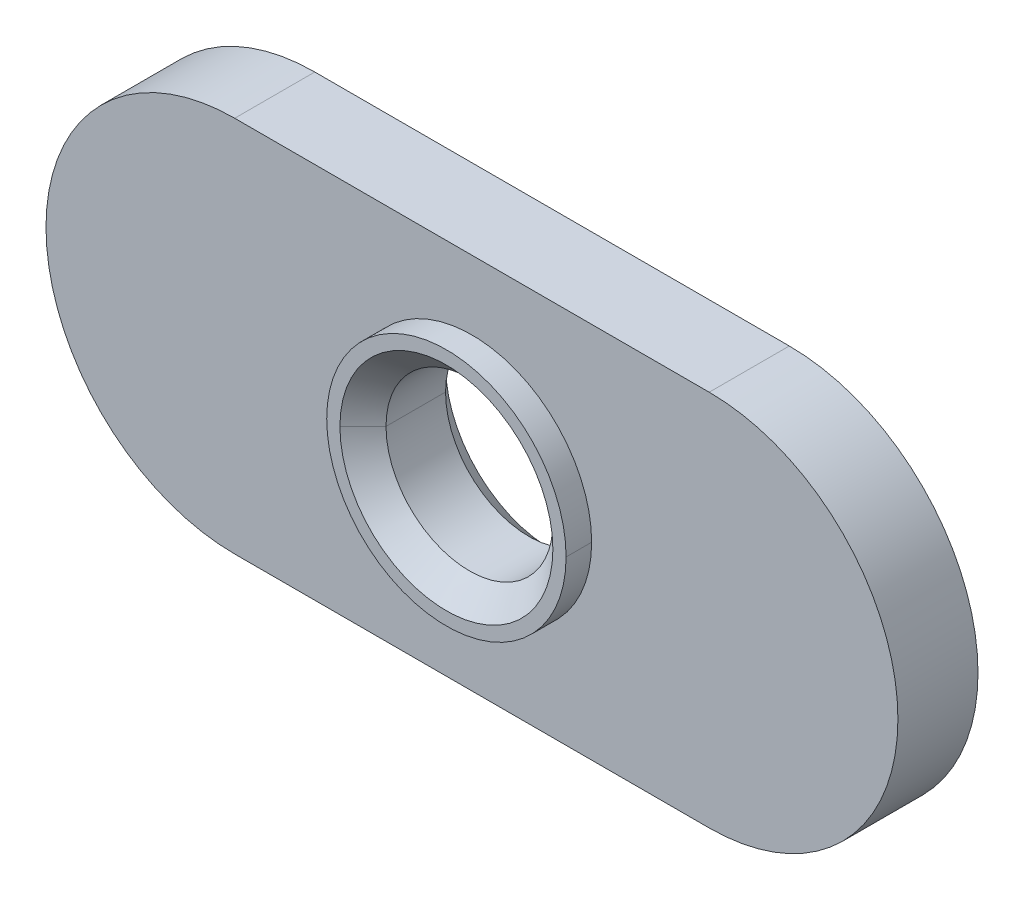
ISO-10303-21;
HEADER;
FILE_DESCRIPTION(('STEP AP214'),'2;1');
FILE_NAME('part.step','',(''),(''),'','','');
FILE_SCHEMA(('AUTOMOTIVE_DESIGN { 1 0 10303 214 1 1 1 1 }'));
ENDSEC;
DATA;
#1=APPLICATION_CONTEXT('core data for automotive mechanical design processes');
#2=APPLICATION_PROTOCOL_DEFINITION('international standard','automotive_design',2000,#1);
#3=PRODUCT_CONTEXT('',#1,'mechanical');
#4=PRODUCT('Part','Part','',(#3));
#5=PRODUCT_RELATED_PRODUCT_CATEGORY('part','',(#4));
#6=PRODUCT_DEFINITION_FORMATION('','',#4);
#7=PRODUCT_DEFINITION_CONTEXT('part definition',#1,'design');
#8=PRODUCT_DEFINITION('design','',#6,#7);
#9=PRODUCT_DEFINITION_SHAPE('','',#8);
#10=(LENGTH_UNIT() NAMED_UNIT(*) SI_UNIT(.MILLI.,.METRE.));
#11=(NAMED_UNIT(*) PLANE_ANGLE_UNIT() SI_UNIT($,.RADIAN.));
#12=(NAMED_UNIT(*) SI_UNIT($,.STERADIAN.) SOLID_ANGLE_UNIT());
#13=UNCERTAINTY_MEASURE_WITH_UNIT(LENGTH_MEASURE(1.E-05),#10,'distance_accuracy_value','');
#14=(GEOMETRIC_REPRESENTATION_CONTEXT(3) GLOBAL_UNCERTAINTY_ASSIGNED_CONTEXT((#13)) GLOBAL_UNIT_ASSIGNED_CONTEXT((#10,
#11,#12)) REPRESENTATION_CONTEXT('',''));
#15=CARTESIAN_POINT('',(0.,0.,0.));
#16=DIRECTION('',(0.,0.,1.));
#17=DIRECTION('',(1.,0.,0.));
#18=AXIS2_PLACEMENT_3D('',#15,#16,#17);
#19=CARTESIAN_POINT('',(7.0739,5.6261,1.1938));
#20=DIRECTION('',(0.,-1.,0.));
#21=DIRECTION('',(0.,0.,-1.));
#22=AXIS2_PLACEMENT_3D('',#19,#20,#21);
#23=PLANE('',#22);
#24=DIRECTION('',(-1.,0.,0.));
#25=VECTOR('',#24,1.);
#26=CARTESIAN_POINT('',(7.0739,5.6261,-1.1938));
#27=LINE('',#26,#25);
#28=CARTESIAN_POINT('',(7.0739,5.6261,-1.1938));
#29=VERTEX_POINT('',#28);
#30=CARTESIAN_POINT('',(-7.0739,5.6261,-1.1938));
#31=VERTEX_POINT('',#30);
#32=EDGE_CURVE('E11',#29,#31,#27,.T.);
#33=ORIENTED_EDGE('',*,*,#32,.T.);
#34=DIRECTION('',(0.,0.,-1.));
#35=VECTOR('',#34,1.);
#36=CARTESIAN_POINT('',(-7.0739,5.6261,1.1938));
#37=LINE('',#36,#35);
#38=CARTESIAN_POINT('',(-7.0739,5.6261,1.1938));
#39=VERTEX_POINT('',#38);
#40=EDGE_CURVE('E24',#39,#31,#37,.T.);
#41=ORIENTED_EDGE('',*,*,#40,.F.);
#42=DIRECTION('',(-1.,0.,0.));
#43=VECTOR('',#42,1.);
#44=CARTESIAN_POINT('',(7.0739,5.6261,1.1938));
#45=LINE('',#44,#43);
#46=CARTESIAN_POINT('',(7.0739,5.6261,1.1938));
#47=VERTEX_POINT('',#46);
#48=EDGE_CURVE('E246',#47,#39,#45,.T.);
#49=ORIENTED_EDGE('',*,*,#48,.F.);
#50=DIRECTION('',(0.,0.,-1.));
#51=VECTOR('',#50,1.);
#52=CARTESIAN_POINT('',(7.0739,5.6261,1.1938));
#53=LINE('',#52,#51);
#54=EDGE_CURVE('E242',#47,#29,#53,.T.);
#55=ORIENTED_EDGE('',*,*,#54,.T.);
#56=EDGE_LOOP('',(#33,#41,#49,#55));
#57=FACE_BOUND('',#56,.T.);
#58=ADVANCED_FACE('F16',(#57),#23,.F.);
#59=CARTESIAN_POINT('',(7.0739,0.,1.1938));
#60=DIRECTION('',(0.,0.,-1.));
#61=DIRECTION('',(-1.,0.,0.));
#62=AXIS2_PLACEMENT_3D('',#59,#60,#61);
#63=CYLINDRICAL_SURFACE('',#62,5.6261);
#64=CARTESIAN_POINT('',(7.0739,0.,-1.1938));
#65=DIRECTION('',(0.,0.,1.));
#66=DIRECTION('',(1.,0.,0.));
#67=AXIS2_PLACEMENT_3D('',#64,#65,#66);
#68=CIRCLE('',#67,5.6261);
#69=CARTESIAN_POINT('',(7.0739,-5.6261,-1.1938));
#70=VERTEX_POINT('',#69);
#71=EDGE_CURVE('E237',#70,#29,#68,.T.);
#72=ORIENTED_EDGE('',*,*,#71,.T.);
#73=ORIENTED_EDGE('',*,*,#54,.F.);
#74=CARTESIAN_POINT('',(7.0739,0.,1.1938));
#75=DIRECTION('',(0.,0.,1.));
#76=DIRECTION('',(1.,0.,0.));
#77=AXIS2_PLACEMENT_3D('',#74,#75,#76);
#78=CIRCLE('',#77,5.6261);
#79=CARTESIAN_POINT('',(7.0739,-5.6261,1.1938));
#80=VERTEX_POINT('',#79);
#81=EDGE_CURVE('E232',#80,#47,#78,.T.);
#82=ORIENTED_EDGE('',*,*,#81,.F.);
#83=DIRECTION('',(0.,0.,-1.));
#84=VECTOR('',#83,1.);
#85=CARTESIAN_POINT('',(7.0739,-5.6261,1.1938));
#86=LINE('',#85,#84);
#87=EDGE_CURVE('E228',#80,#70,#86,.T.);
#88=ORIENTED_EDGE('',*,*,#87,.T.);
#89=EDGE_LOOP('',(#72,#73,#82,#88));
#90=FACE_BOUND('',#89,.T.);
#91=ADVANCED_FACE('F264',(#90),#63,.T.);
#92=CARTESIAN_POINT('',(-7.0739,-5.6261,1.1938));
#93=DIRECTION('',(0.,1.,0.));
#94=DIRECTION('',(0.,0.,1.));
#95=AXIS2_PLACEMENT_3D('',#92,#93,#94);
#96=PLANE('',#95);
#97=DIRECTION('',(1.,0.,0.));
#98=VECTOR('',#97,1.);
#99=CARTESIAN_POINT('',(-7.0739,-5.6261,-1.1938));
#100=LINE('',#99,#98);
#101=CARTESIAN_POINT('',(-7.0739,-5.6261,-1.1938));
#102=VERTEX_POINT('',#101);
#103=EDGE_CURVE('E223',#102,#70,#100,.T.);
#104=ORIENTED_EDGE('',*,*,#103,.T.);
#105=ORIENTED_EDGE('',*,*,#87,.F.);
#106=DIRECTION('',(1.,0.,0.));
#107=VECTOR('',#106,1.);
#108=CARTESIAN_POINT('',(-7.0739,-5.6261,1.1938));
#109=LINE('',#108,#107);
#110=CARTESIAN_POINT('',(-7.0739,-5.6261,1.1938));
#111=VERTEX_POINT('',#110);
#112=EDGE_CURVE('E218',#111,#80,#109,.T.);
#113=ORIENTED_EDGE('',*,*,#112,.F.);
#114=DIRECTION('',(0.,0.,-1.));
#115=VECTOR('',#114,1.);
#116=CARTESIAN_POINT('',(-7.0739,-5.6261,1.1938));
#117=LINE('',#116,#115);
#118=EDGE_CURVE('E214',#111,#102,#117,.T.);
#119=ORIENTED_EDGE('',*,*,#118,.T.);
#120=EDGE_LOOP('',(#104,#105,#113,#119));
#121=FACE_BOUND('',#120,.T.);
#122=ADVANCED_FACE('F267',(#121),#96,.F.);
#123=CARTESIAN_POINT('',(-7.0739,0.,1.1938));
#124=DIRECTION('',(0.,0.,-1.));
#125=DIRECTION('',(1.,0.,0.));
#126=AXIS2_PLACEMENT_3D('',#123,#124,#125);
#127=CYLINDRICAL_SURFACE('',#126,5.6261);
#128=CARTESIAN_POINT('',(-7.0739,0.,-1.1938));
#129=DIRECTION('',(0.,0.,1.));
#130=DIRECTION('',(1.,0.,0.));
#131=AXIS2_PLACEMENT_3D('',#128,#129,#130);
#132=CIRCLE('',#131,5.6261);
#133=EDGE_CURVE('E209',#31,#102,#132,.T.);
#134=ORIENTED_EDGE('',*,*,#133,.T.);
#135=ORIENTED_EDGE('',*,*,#118,.F.);
#136=CARTESIAN_POINT('',(-7.0739,0.,1.1938));
#137=DIRECTION('',(0.,0.,1.));
#138=DIRECTION('',(1.,0.,0.));
#139=AXIS2_PLACEMENT_3D('',#136,#137,#138);
#140=CIRCLE('',#139,5.6261);
#141=EDGE_CURVE('E204',#39,#111,#140,.T.);
#142=ORIENTED_EDGE('',*,*,#141,.F.);
#143=ORIENTED_EDGE('',*,*,#40,.T.);
#144=EDGE_LOOP('',(#134,#135,#142,#143));
#145=FACE_BOUND('',#144,.T.);
#146=ADVANCED_FACE('F256',(#145),#127,.T.);
#147=CARTESIAN_POINT('',(-7.0739,0.,1.1938));
#148=DIRECTION('',(0.,0.,1.));
#149=DIRECTION('',(1.,0.,0.));
#150=AXIS2_PLACEMENT_3D('',#147,#148,#149);
#151=PLANE('',#150);
#152=CARTESIAN_POINT('',(0.,0.,1.1938));
#153=DIRECTION('',(0.,0.,-1.));
#154=DIRECTION('',(1.,0.,0.));
#155=AXIS2_PLACEMENT_3D('',#152,#153,#154);
#156=CIRCLE('',#155,3.5687);
#157=CARTESIAN_POINT('',(3.5687,0.,1.1938));
#158=VERTEX_POINT('',#157);
#159=CARTESIAN_POINT('',(-3.5687,0.,1.1938));
#160=VERTEX_POINT('',#159);
#161=EDGE_CURVE('E200',#158,#160,#156,.T.);
#162=ORIENTED_EDGE('',*,*,#161,.T.);
#163=CARTESIAN_POINT('',(0.,0.,1.1938));
#164=DIRECTION('',(0.,0.,-1.));
#165=DIRECTION('',(1.,0.,0.));
#166=AXIS2_PLACEMENT_3D('',#163,#164,#165);
#167=CIRCLE('',#166,3.5687);
#168=EDGE_CURVE('E196',#160,#158,#167,.T.);
#169=ORIENTED_EDGE('',*,*,#168,.T.);
#170=EDGE_LOOP('',(#162,#169));
#171=FACE_BOUND('',#170,.T.);
#172=ORIENTED_EDGE('',*,*,#48,.T.);
#173=ORIENTED_EDGE('',*,*,#141,.T.);
#174=ORIENTED_EDGE('',*,*,#112,.T.);
#175=ORIENTED_EDGE('',*,*,#81,.T.);
#176=EDGE_LOOP('',(#172,#173,#174,#175));
#177=FACE_BOUND('',#176,.T.);
#178=ADVANCED_FACE('F260',(#171,#177),#151,.T.);
#179=CARTESIAN_POINT('',(0.,0.,1.9558));
#180=DIRECTION('',(0.,0.,-1.));
#181=DIRECTION('',(0.,-1.,0.));
#182=AXIS2_PLACEMENT_3D('',#179,#180,#181);
#183=CYLINDRICAL_SURFACE('',#182,3.5687);
#184=DIRECTION('',(0.,0.,-1.));
#185=VECTOR('',#184,1.);
#186=CARTESIAN_POINT('',(3.5687,0.,1.9558));
#187=LINE('',#186,#185);
#188=CARTESIAN_POINT('',(3.5687,0.,1.9558));
#189=VERTEX_POINT('',#188);
#190=EDGE_CURVE('E191',#189,#158,#187,.T.);
#191=ORIENTED_EDGE('',*,*,#190,.T.);
#192=ORIENTED_EDGE('',*,*,#168,.F.);
#193=DIRECTION('',(0.,0.,-1.));
#194=VECTOR('',#193,1.);
#195=CARTESIAN_POINT('',(-3.5687,0.,1.9558));
#196=LINE('',#195,#194);
#197=CARTESIAN_POINT('',(-3.5687,0.,1.9558));
#198=VERTEX_POINT('',#197);
#199=EDGE_CURVE('E186',#198,#160,#196,.T.);
#200=ORIENTED_EDGE('',*,*,#199,.F.);
#201=CARTESIAN_POINT('',(0.,0.,1.9558));
#202=DIRECTION('',(0.,0.,1.));
#203=DIRECTION('',(1.,0.,0.));
#204=AXIS2_PLACEMENT_3D('',#201,#202,#203);
#205=CIRCLE('',#204,3.5687);
#206=EDGE_CURVE('E181',#189,#198,#205,.T.);
#207=ORIENTED_EDGE('',*,*,#206,.F.);
#208=EDGE_LOOP('',(#191,#192,#200,#207));
#209=FACE_BOUND('',#208,.T.);
#210=ADVANCED_FACE('F311',(#209),#183,.T.);
#211=CARTESIAN_POINT('',(0.,0.,1.9558));
#212=DIRECTION('',(0.,0.,1.));
#213=DIRECTION('',(1.,0.,0.));
#214=AXIS2_PLACEMENT_3D('',#211,#212,#213);
#215=PLANE('',#214);
#216=CARTESIAN_POINT('',(0.,0.,1.9558));
#217=DIRECTION('',(0.,0.,-1.));
#218=DIRECTION('',(-1.,0.,0.));
#219=AXIS2_PLACEMENT_3D('',#216,#217,#218);
#220=CIRCLE('',#219,3.175);
#221=CARTESIAN_POINT('',(-3.175,0.,1.9558));
#222=VERTEX_POINT('',#221);
#223=CARTESIAN_POINT('',(3.175,0.,1.9558));
#224=VERTEX_POINT('',#223);
#225=EDGE_CURVE('E177',#222,#224,#220,.T.);
#226=ORIENTED_EDGE('',*,*,#225,.T.);
#227=CARTESIAN_POINT('',(0.,0.,1.9558));
#228=DIRECTION('',(0.,0.,-1.));
#229=DIRECTION('',(-1.,0.,0.));
#230=AXIS2_PLACEMENT_3D('',#227,#228,#229);
#231=CIRCLE('',#230,3.175);
#232=EDGE_CURVE('E173',#224,#222,#231,.T.);
#233=ORIENTED_EDGE('',*,*,#232,.T.);
#234=EDGE_LOOP('',(#226,#233));
#235=FACE_BOUND('',#234,.T.);
#236=ORIENTED_EDGE('',*,*,#206,.T.);
#237=CARTESIAN_POINT('',(0.,0.,1.9558));
#238=DIRECTION('',(0.,0.,1.));
#239=DIRECTION('',(1.,0.,0.));
#240=AXIS2_PLACEMENT_3D('',#237,#238,#239);
#241=CIRCLE('',#240,3.5687);
#242=EDGE_CURVE('E168',#198,#189,#241,.T.);
#243=ORIENTED_EDGE('',*,*,#242,.T.);
#244=EDGE_LOOP('',(#236,#243));
#245=FACE_BOUND('',#244,.T.);
#246=ADVANCED_FACE('F322',(#235,#245),#215,.T.);
#247=CARTESIAN_POINT('',(0.,0.,1.9558));
#248=DIRECTION('',(0.,0.,-1.));
#249=DIRECTION('',(0.,1.,0.));
#250=AXIS2_PLACEMENT_3D('',#247,#248,#249);
#251=CYLINDRICAL_SURFACE('',#250,3.5687);
#252=ORIENTED_EDGE('',*,*,#190,.F.);
#253=ORIENTED_EDGE('',*,*,#242,.F.);
#254=ORIENTED_EDGE('',*,*,#199,.T.);
#255=ORIENTED_EDGE('',*,*,#161,.F.);
#256=EDGE_LOOP('',(#252,#253,#254,#255));
#257=FACE_BOUND('',#256,.T.);
#258=ADVANCED_FACE('F333',(#257),#251,.T.);
#259=CARTESIAN_POINT('',(0.,0.,1.9558));
#260=DIRECTION('',(0.,0.,1.));
#261=DIRECTION('',(0.,1.,0.));
#262=AXIS2_PLACEMENT_3D('',#259,#260,#261);
#263=CONICAL_SURFACE('',#262,3.175,0.785398163397448);
#264=DIRECTION('',(-0.707106781186547,0.,0.707106781186548));
#265=VECTOR('',#264,1.);
#266=CARTESIAN_POINT('',(-2.48793,0.,1.26873));
#267=LINE('',#266,#265);
#268=CARTESIAN_POINT('',(-2.48793,0.,1.26873));
#269=VERTEX_POINT('',#268);
#270=EDGE_CURVE('E163',#269,#222,#267,.T.);
#271=ORIENTED_EDGE('',*,*,#270,.T.);
#272=ORIENTED_EDGE('',*,*,#232,.F.);
#273=DIRECTION('',(0.707106781186547,0.,0.707106781186548));
#274=VECTOR('',#273,1.);
#275=CARTESIAN_POINT('',(2.48793,0.,1.26873));
#276=LINE('',#275,#274);
#277=CARTESIAN_POINT('',(2.48793,0.,1.26873));
#278=VERTEX_POINT('',#277);
#279=EDGE_CURVE('E158',#278,#224,#276,.T.);
#280=ORIENTED_EDGE('',*,*,#279,.F.);
#281=CARTESIAN_POINT('',(0.,0.,1.26873));
#282=DIRECTION('',(0.,0.,-1.));
#283=DIRECTION('',(-1.,0.,0.));
#284=AXIS2_PLACEMENT_3D('',#281,#282,#283);
#285=CIRCLE('',#284,2.48793);
#286=CARTESIAN_POINT('',(2.3661620385862,-0.768812650815263,1.26873));
#287=VERTEX_POINT('',#286);
#288=EDGE_CURVE('E154',#278,#287,#285,.T.);
#289=ORIENTED_EDGE('',*,*,#288,.T.);
#290=CARTESIAN_POINT('',(0.,0.,1.26873));
#291=DIRECTION('',(0.,0.,-1.));
#292=DIRECTION('',(-1.,0.,0.));
#293=AXIS2_PLACEMENT_3D('',#290,#291,#292);
#294=CIRCLE('',#293,2.48793);
#295=EDGE_CURVE('E150',#287,#269,#294,.T.);
#296=ORIENTED_EDGE('',*,*,#295,.T.);
#297=EDGE_LOOP('',(#271,#272,#280,#289,#296));
#298=FACE_BOUND('',#297,.T.);
#299=ADVANCED_FACE('F344',(#298),#263,.F.);
#300=CARTESIAN_POINT('',(0.,0.,-1.1938));
#301=DIRECTION('',(0.,0.,-1.));
#302=DIRECTION('',(0.156434465040231,0.987688340595138,0.));
#303=AXIS2_PLACEMENT_3D('',#300,#301,#302);
#304=CYLINDRICAL_SURFACE('',#303,2.48793);
#305=DIRECTION('',(0.,0.,-1.));
#306=VECTOR('',#305,1.);
#307=CARTESIAN_POINT('',(2.3661620385862,-0.768812650815263,1.26873));
#308=LINE('',#307,#306);
#309=CARTESIAN_POINT('',(2.3661620385862,-0.768812650815263,-0.50673));
#310=VERTEX_POINT('',#309);
#311=EDGE_CURVE('E146',#287,#310,#308,.T.);
#312=ORIENTED_EDGE('',*,*,#311,.T.);
#313=CARTESIAN_POINT('',(0.,0.,-0.50673));
#314=DIRECTION('',(0.,0.,-1.));
#315=DIRECTION('',(-1.,0.,0.));
#316=AXIS2_PLACEMENT_3D('',#313,#314,#315);
#317=CIRCLE('',#316,2.48793);
#318=CARTESIAN_POINT('',(-2.48793,0.,-0.50673));
#319=VERTEX_POINT('',#318);
#320=EDGE_CURVE('E142',#310,#319,#317,.T.);
#321=ORIENTED_EDGE('',*,*,#320,.T.);
#322=DIRECTION('',(0.,0.,-1.));
#323=VECTOR('',#322,1.);
#324=CARTESIAN_POINT('',(-2.48793,0.,1.26873));
#325=LINE('',#324,#323);
#326=EDGE_CURVE('E138',#269,#319,#325,.T.);
#327=ORIENTED_EDGE('',*,*,#326,.F.);
#328=ORIENTED_EDGE('',*,*,#295,.F.);
#329=EDGE_LOOP('',(#312,#321,#327,#328));
#330=FACE_BOUND('',#329,.T.);
#331=ADVANCED_FACE('F355',(#330),#304,.F.);
#332=CARTESIAN_POINT('',(0.,0.,-1.1938));
#333=DIRECTION('',(0.,0.,-1.));
#334=DIRECTION('',(-0.156434465040231,-0.987688340595138,0.));
#335=AXIS2_PLACEMENT_3D('',#332,#333,#334);
#336=CYLINDRICAL_SURFACE('',#335,2.48793);
#337=ORIENTED_EDGE('',*,*,#311,.F.);
#338=ORIENTED_EDGE('',*,*,#288,.F.);
#339=CARTESIAN_POINT('',(0.,0.,1.26873));
#340=DIRECTION('',(0.,0.,-1.));
#341=DIRECTION('',(-1.,0.,0.));
#342=AXIS2_PLACEMENT_3D('',#339,#340,#341);
#343=CIRCLE('',#342,2.48793);
#344=EDGE_CURVE('E133',#269,#278,#343,.T.);
#345=ORIENTED_EDGE('',*,*,#344,.F.);
#346=ORIENTED_EDGE('',*,*,#326,.T.);
#347=CARTESIAN_POINT('',(0.,0.,-0.50673));
#348=DIRECTION('',(0.,0.,-1.));
#349=DIRECTION('',(-1.,0.,0.));
#350=AXIS2_PLACEMENT_3D('',#347,#348,#349);
#351=CIRCLE('',#350,2.48793);
#352=CARTESIAN_POINT('',(2.48793,0.,-0.50673));
#353=VERTEX_POINT('',#352);
#354=EDGE_CURVE('E114',#319,#353,#351,.T.);
#355=ORIENTED_EDGE('',*,*,#354,.T.);
#356=CARTESIAN_POINT('',(0.,0.,-0.50673));
#357=DIRECTION('',(0.,0.,-1.));
#358=DIRECTION('',(-1.,0.,0.));
#359=AXIS2_PLACEMENT_3D('',#356,#357,#358);
#360=CIRCLE('',#359,2.48793);
#361=EDGE_CURVE('E125',#353,#310,#360,.T.);
#362=ORIENTED_EDGE('',*,*,#361,.T.);
#363=EDGE_LOOP('',(#337,#338,#345,#346,#355,#362));
#364=FACE_BOUND('',#363,.T.);
#365=ADVANCED_FACE('F366',(#364),#336,.F.);
#366=CARTESIAN_POINT('',(0.,0.,-0.50673));
#367=DIRECTION('',(0.,0.,-1.));
#368=DIRECTION('',(0.,1.,0.));
#369=AXIS2_PLACEMENT_3D('',#366,#367,#368);
#370=CONICAL_SURFACE('',#369,2.48793,0.785398163397448);
#371=DIRECTION('',(0.707106781186547,0.,-0.707106781186548));
#372=VECTOR('',#371,1.);
#373=CARTESIAN_POINT('',(2.48793,0.,-0.50673));
#374=LINE('',#373,#372);
#375=CARTESIAN_POINT('',(3.175,0.,-1.1938));
#376=VERTEX_POINT('',#375);
#377=EDGE_CURVE('E104',#353,#376,#374,.T.);
#378=ORIENTED_EDGE('',*,*,#377,.T.);
#379=CARTESIAN_POINT('',(0.,0.,-1.1938));
#380=DIRECTION('',(0.,0.,-1.));
#381=DIRECTION('',(-1.,0.,0.));
#382=AXIS2_PLACEMENT_3D('',#379,#380,#381);
#383=CIRCLE('',#382,3.175);
#384=CARTESIAN_POINT('',(-3.175,0.,-1.1938));
#385=VERTEX_POINT('',#384);
#386=EDGE_CURVE('E95',#376,#385,#383,.T.);
#387=ORIENTED_EDGE('',*,*,#386,.T.);
#388=DIRECTION('',(-0.707106781186547,0.,-0.707106781186548));
#389=VECTOR('',#388,1.);
#390=CARTESIAN_POINT('',(-2.48793,0.,-0.50673));
#391=LINE('',#390,#389);
#392=EDGE_CURVE('E100',#319,#385,#391,.T.);
#393=ORIENTED_EDGE('',*,*,#392,.F.);
#394=ORIENTED_EDGE('',*,*,#320,.F.);
#395=ORIENTED_EDGE('',*,*,#361,.F.);
#396=EDGE_LOOP('',(#378,#387,#393,#394,#395));
#397=FACE_BOUND('',#396,.T.);
#398=ADVANCED_FACE('F97',(#397),#370,.F.);
#399=CARTESIAN_POINT('',(0.,0.,-0.50673));
#400=DIRECTION('',(0.,0.,-1.));
#401=DIRECTION('',(0.,-1.,0.));
#402=AXIS2_PLACEMENT_3D('',#399,#400,#401);
#403=CONICAL_SURFACE('',#402,2.48793,0.785398163397448);
#404=ORIENTED_EDGE('',*,*,#377,.F.);
#405=ORIENTED_EDGE('',*,*,#354,.F.);
#406=ORIENTED_EDGE('',*,*,#392,.T.);
#407=CARTESIAN_POINT('',(0.,0.,-1.1938));
#408=DIRECTION('',(0.,0.,-1.));
#409=DIRECTION('',(-1.,0.,0.));
#410=AXIS2_PLACEMENT_3D('',#407,#408,#409);
#411=CIRCLE('',#410,3.175);
#412=EDGE_CURVE('E108',#385,#376,#411,.T.);
#413=ORIENTED_EDGE('',*,*,#412,.T.);
#414=EDGE_LOOP('',(#404,#405,#406,#413));
#415=FACE_BOUND('',#414,.T.);
#416=ADVANCED_FACE('F113',(#415),#403,.F.);
#417=CARTESIAN_POINT('',(-7.0739,0.,-1.1938));
#418=DIRECTION('',(0.,0.,1.));
#419=DIRECTION('',(1.,0.,0.));
#420=AXIS2_PLACEMENT_3D('',#417,#418,#419);
#421=PLANE('',#420);
#422=ORIENTED_EDGE('',*,*,#386,.F.);
#423=ORIENTED_EDGE('',*,*,#412,.F.);
#424=EDGE_LOOP('',(#422,#423));
#425=FACE_BOUND('',#424,.T.);
#426=ORIENTED_EDGE('',*,*,#32,.F.);
#427=ORIENTED_EDGE('',*,*,#71,.F.);
#428=ORIENTED_EDGE('',*,*,#103,.F.);
#429=ORIENTED_EDGE('',*,*,#133,.F.);
#430=EDGE_LOOP('',(#426,#427,#428,#429));
#431=FACE_BOUND('',#430,.T.);
#432=ADVANCED_FACE('F109',(#425,#431),#421,.F.);
#433=CARTESIAN_POINT('',(0.,0.,1.9558));
#434=DIRECTION('',(0.,0.,1.));
#435=DIRECTION('',(0.,-1.,0.));
#436=AXIS2_PLACEMENT_3D('',#433,#434,#435);
#437=CONICAL_SURFACE('',#436,3.175,0.785398163397448);
#438=ORIENTED_EDGE('',*,*,#270,.F.);
#439=ORIENTED_EDGE('',*,*,#344,.T.);
#440=ORIENTED_EDGE('',*,*,#279,.T.);
#441=ORIENTED_EDGE('',*,*,#225,.F.);
#442=EDGE_LOOP('',(#438,#439,#440,#441));
#443=FACE_BOUND('',#442,.T.);
#444=ADVANCED_FACE('F405',(#443),#437,.F.);
#445=CLOSED_SHELL('',(#58,#91,#122,#146,#178,#210,#246,#258,#299,#331,#365,#398,#416,#432,#444));
#446=MANIFOLD_SOLID_BREP('B1',#445);
#447=ADVANCED_BREP_SHAPE_REPRESENTATION('',(#18,#446),#14);
#448=SHAPE_DEFINITION_REPRESENTATION(#9,#447);
ENDSEC;
END-ISO-10303-21;
